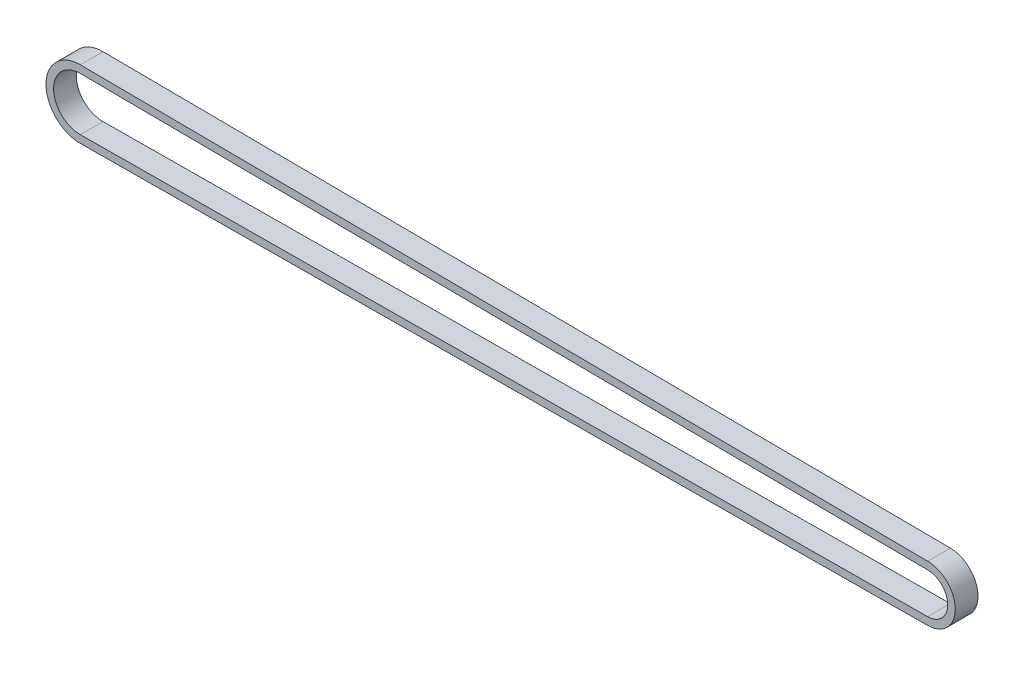
ISO-10303-21;
HEADER;
FILE_DESCRIPTION(('STEP AP214'),'2;1');
FILE_NAME('part.step','',(''),(''),'','','');
FILE_SCHEMA(('AUTOMOTIVE_DESIGN { 1 0 10303 214 1 1 1 1 }'));
ENDSEC;
DATA;
#1=APPLICATION_CONTEXT('core data for automotive mechanical design processes');
#2=APPLICATION_PROTOCOL_DEFINITION('international standard','automotive_design',2000,#1);
#3=PRODUCT_CONTEXT('',#1,'mechanical');
#4=PRODUCT('Part','Part','',(#3));
#5=PRODUCT_RELATED_PRODUCT_CATEGORY('part','',(#4));
#6=PRODUCT_DEFINITION_FORMATION('','',#4);
#7=PRODUCT_DEFINITION_CONTEXT('part definition',#1,'design');
#8=PRODUCT_DEFINITION('design','',#6,#7);
#9=PRODUCT_DEFINITION_SHAPE('','',#8);
#10=(LENGTH_UNIT() NAMED_UNIT(*) SI_UNIT(.MILLI.,.METRE.));
#11=(NAMED_UNIT(*) PLANE_ANGLE_UNIT() SI_UNIT($,.RADIAN.));
#12=(NAMED_UNIT(*) SI_UNIT($,.STERADIAN.) SOLID_ANGLE_UNIT());
#13=UNCERTAINTY_MEASURE_WITH_UNIT(LENGTH_MEASURE(1.E-05),#10,'distance_accuracy_value','');
#14=(GEOMETRIC_REPRESENTATION_CONTEXT(3) GLOBAL_UNCERTAINTY_ASSIGNED_CONTEXT((#13)) GLOBAL_UNIT_ASSIGNED_CONTEXT((#10,
#11,#12)) REPRESENTATION_CONTEXT('',''));
#15=CARTESIAN_POINT('',(0.,0.,0.));
#16=DIRECTION('',(0.,0.,1.));
#17=DIRECTION('',(1.,0.,0.));
#18=AXIS2_PLACEMENT_3D('',#15,#16,#17);
#19=CARTESIAN_POINT('',(112.823223304707,-5.48172618408671E-12,6.));
#20=DIRECTION('',(0.,0.,-1.));
#21=DIRECTION('',(-1.,0.,0.));
#22=AXIS2_PLACEMENT_3D('',#19,#20,#21);
#23=PLANE('',#22);
#24=CARTESIAN_POINT('',(112.823223304707,-5.48172618408671E-12,6.));
#25=DIRECTION('',(0.,0.,1.));
#26=DIRECTION('',(-1.,0.,0.));
#27=AXIS2_PLACEMENT_3D('',#24,#25,#26);
#28=CIRCLE('',#27,7.35355339059);
#29=CARTESIAN_POINT('',(112.877273452238,-7.35335474799701,6.));
#30=VERTEX_POINT('',#29);
#31=CARTESIAN_POINT('',(112.877273452239,7.35335474798604,6.));
#32=VERTEX_POINT('',#31);
#33=EDGE_CURVE('E159',#30,#32,#28,.T.);
#34=ORIENTED_EDGE('',*,*,#33,.T.);
#35=DIRECTION('',(-0.999972986855752,0.00735020807774755,0.));
#36=VECTOR('',#35,1.);
#37=CARTESIAN_POINT('',(-111.110624822597,8.99975688170177,6.));
#38=LINE('',#37,#36);
#39=CARTESIAN_POINT('',(-111.110624822597,8.99975688170177,6.));
#40=VERTEX_POINT('',#39);
#41=EDGE_CURVE('E163',#32,#40,#38,.T.);
#42=ORIENTED_EDGE('',*,*,#41,.T.);
#43=CARTESIAN_POINT('',(-111.176776695297,0.,6.));
#44=DIRECTION('',(0.,0.,1.));
#45=DIRECTION('',(-1.,0.,0.));
#46=AXIS2_PLACEMENT_3D('',#43,#44,#45);
#47=CIRCLE('',#46,9.);
#48=CARTESIAN_POINT('',(-111.110624822598,-8.99975688170177,6.));
#49=VERTEX_POINT('',#48);
#50=EDGE_CURVE('E167',#40,#49,#47,.T.);
#51=ORIENTED_EDGE('',*,*,#50,.T.);
#52=DIRECTION('',(0.999972986855752,0.0073502080776986,0.));
#53=VECTOR('',#52,1.);
#54=CARTESIAN_POINT('',(112.877273452238,-7.35335474799701,6.));
#55=LINE('',#54,#53);
#56=EDGE_CURVE('E170',#49,#30,#55,.T.);
#57=ORIENTED_EDGE('',*,*,#56,.T.);
#58=EDGE_LOOP('',(#34,#42,#51,#57));
#59=FACE_BOUND('',#58,.T.);
#60=CARTESIAN_POINT('',(112.823223304707,-5.48172618408671E-12,6.));
#61=DIRECTION('',(0.,0.,1.));
#62=DIRECTION('',(-1.,0.,0.));
#63=AXIS2_PLACEMENT_3D('',#60,#61,#62);
#64=CIRCLE('',#63,5.35355339059);
#65=CARTESIAN_POINT('',(112.862573036083,-5.3534087742855,6.));
#66=VERTEX_POINT('',#65);
#67=CARTESIAN_POINT('',(112.862573036083,5.35340877427454,6.));
#68=VERTEX_POINT('',#67);
#69=EDGE_CURVE('E111',#66,#68,#64,.T.);
#70=ORIENTED_EDGE('',*,*,#69,.F.);
#71=DIRECTION('',(0.999972986855752,0.0073502080776986,0.));
#72=VECTOR('',#71,1.);
#73=CARTESIAN_POINT('',(112.862573036083,-5.3534087742855,6.));
#74=LINE('',#73,#72);
#75=CARTESIAN_POINT('',(-111.125325238753,-6.99981090799027,6.));
#76=VERTEX_POINT('',#75);
#77=EDGE_CURVE('E137',#76,#66,#74,.T.);
#78=ORIENTED_EDGE('',*,*,#77,.F.);
#79=CARTESIAN_POINT('',(-111.176776695297,0.,6.));
#80=DIRECTION('',(0.,0.,1.));
#81=DIRECTION('',(-1.,0.,0.));
#82=AXIS2_PLACEMENT_3D('',#79,#80,#81);
#83=CIRCLE('',#82,7.);
#84=CARTESIAN_POINT('',(-111.125325238753,6.99981090799027,6.));
#85=VERTEX_POINT('',#84);
#86=EDGE_CURVE('E133',#85,#76,#83,.T.);
#87=ORIENTED_EDGE('',*,*,#86,.F.);
#88=DIRECTION('',(-0.999972986855752,0.00735020807774755,0.));
#89=VECTOR('',#88,1.);
#90=CARTESIAN_POINT('',(-111.125325238753,6.99981090799027,6.));
#91=LINE('',#90,#89);
#92=EDGE_CURVE('E120',#68,#85,#91,.T.);
#93=ORIENTED_EDGE('',*,*,#92,.F.);
#94=EDGE_LOOP('',(#70,#78,#87,#93));
#95=FACE_BOUND('',#94,.T.);
#96=ADVANCED_FACE('F45',(#59,#95),#23,.F.);
#97=CARTESIAN_POINT('',(112.823223304707,-5.48172618408671E-12,0.));
#98=DIRECTION('',(0.,0.,-1.));
#99=DIRECTION('',(-1.,0.,0.));
#100=AXIS2_PLACEMENT_3D('',#97,#98,#99);
#101=PLANE('',#100);
#102=CARTESIAN_POINT('',(112.823223304707,-5.48172618408671E-12,0.));
#103=DIRECTION('',(0.,0.,1.));
#104=DIRECTION('',(-1.,0.,0.));
#105=AXIS2_PLACEMENT_3D('',#102,#103,#104);
#106=CIRCLE('',#105,7.35355339059);
#107=CARTESIAN_POINT('',(112.877273452238,-7.35335474799701,0.));
#108=VERTEX_POINT('',#107);
#109=CARTESIAN_POINT('',(112.877273452239,7.35335474798604,0.));
#110=VERTEX_POINT('',#109);
#111=EDGE_CURVE('E129',#108,#110,#106,.T.);
#112=ORIENTED_EDGE('',*,*,#111,.F.);
#113=DIRECTION('',(0.999972986855752,0.0073502080776986,0.));
#114=VECTOR('',#113,1.);
#115=CARTESIAN_POINT('',(112.877273452238,-7.35335474799701,0.));
#116=LINE('',#115,#114);
#117=CARTESIAN_POINT('',(-111.110624822598,-8.99975688170177,0.));
#118=VERTEX_POINT('',#117);
#119=EDGE_CURVE('E164',#118,#108,#116,.T.);
#120=ORIENTED_EDGE('',*,*,#119,.F.);
#121=CARTESIAN_POINT('',(-111.176776695297,0.,0.));
#122=DIRECTION('',(0.,0.,1.));
#123=DIRECTION('',(-1.,0.,0.));
#124=AXIS2_PLACEMENT_3D('',#121,#122,#123);
#125=CIRCLE('',#124,9.);
#126=CARTESIAN_POINT('',(-111.110624822597,8.99975688170177,0.));
#127=VERTEX_POINT('',#126);
#128=EDGE_CURVE('E180',#127,#118,#125,.T.);
#129=ORIENTED_EDGE('',*,*,#128,.F.);
#130=DIRECTION('',(-0.999972986855752,0.00735020807774755,0.));
#131=VECTOR('',#130,1.);
#132=CARTESIAN_POINT('',(-111.110624822597,8.99975688170177,0.));
#133=LINE('',#132,#131);
#134=EDGE_CURVE('E177',#110,#127,#133,.T.);
#135=ORIENTED_EDGE('',*,*,#134,.F.);
#136=EDGE_LOOP('',(#112,#120,#129,#135));
#137=FACE_BOUND('',#136,.T.);
#138=DIRECTION('',(0.999972986855752,0.0073502080776986,0.));
#139=VECTOR('',#138,1.);
#140=CARTESIAN_POINT('',(112.862573036083,-5.3534087742855,0.));
#141=LINE('',#140,#139);
#142=CARTESIAN_POINT('',(-111.125325238753,-6.99981090799027,0.));
#143=VERTEX_POINT('',#142);
#144=CARTESIAN_POINT('',(112.862573036083,-5.3534087742855,0.));
#145=VERTEX_POINT('',#144);
#146=EDGE_CURVE('E121',#143,#145,#141,.T.);
#147=ORIENTED_EDGE('',*,*,#146,.T.);
#148=CARTESIAN_POINT('',(112.823223304707,-5.48172618408671E-12,0.));
#149=DIRECTION('',(0.,0.,1.));
#150=DIRECTION('',(-1.,0.,0.));
#151=AXIS2_PLACEMENT_3D('',#148,#149,#150);
#152=CIRCLE('',#151,5.35355339059);
#153=CARTESIAN_POINT('',(112.862573036083,5.35340877427454,0.));
#154=VERTEX_POINT('',#153);
#155=EDGE_CURVE('E69',#145,#154,#152,.T.);
#156=ORIENTED_EDGE('',*,*,#155,.T.);
#157=DIRECTION('',(-0.999972986855752,0.00735020807774755,0.));
#158=VECTOR('',#157,1.);
#159=CARTESIAN_POINT('',(-111.125325238753,6.99981090799027,0.));
#160=LINE('',#159,#158);
#161=CARTESIAN_POINT('',(-111.125325238753,6.99981090799027,0.));
#162=VERTEX_POINT('',#161);
#163=EDGE_CURVE('E127',#154,#162,#160,.T.);
#164=ORIENTED_EDGE('',*,*,#163,.T.);
#165=CARTESIAN_POINT('',(-111.176776695297,0.,0.));
#166=DIRECTION('',(0.,0.,1.));
#167=DIRECTION('',(-1.,0.,0.));
#168=AXIS2_PLACEMENT_3D('',#165,#166,#167);
#169=CIRCLE('',#168,7.);
#170=EDGE_CURVE('E146',#162,#143,#169,.T.);
#171=ORIENTED_EDGE('',*,*,#170,.T.);
#172=EDGE_LOOP('',(#147,#156,#164,#171));
#173=FACE_BOUND('',#172,.T.);
#174=ADVANCED_FACE('F203',(#137,#173),#101,.T.);
#175=CARTESIAN_POINT('',(112.823223304707,-5.48172618408671E-12,6.));
#176=DIRECTION('',(0.,0.,-1.));
#177=DIRECTION('',(-1.,0.,0.));
#178=AXIS2_PLACEMENT_3D('',#175,#176,#177);
#179=CYLINDRICAL_SURFACE('',#178,7.35355339059);
#180=ORIENTED_EDGE('',*,*,#111,.T.);
#181=DIRECTION('',(0.,0.,-1.));
#182=VECTOR('',#181,1.);
#183=CARTESIAN_POINT('',(112.877273452239,7.35335474798604,6.));
#184=LINE('',#183,#182);
#185=EDGE_CURVE('E11',#32,#110,#184,.T.);
#186=ORIENTED_EDGE('',*,*,#185,.F.);
#187=ORIENTED_EDGE('',*,*,#33,.F.);
#188=DIRECTION('',(0.,0.,-1.));
#189=VECTOR('',#188,1.);
#190=CARTESIAN_POINT('',(112.877273452238,-7.35335474799701,6.));
#191=LINE('',#190,#189);
#192=EDGE_CURVE('E173',#30,#108,#191,.T.);
#193=ORIENTED_EDGE('',*,*,#192,.T.);
#194=EDGE_LOOP('',(#180,#186,#187,#193));
#195=FACE_BOUND('',#194,.T.);
#196=ADVANCED_FACE('F47',(#195),#179,.T.);
#197=CARTESIAN_POINT('',(-111.110624822597,8.99975688170177,6.));
#198=DIRECTION('',(-0.00735020807774755,-0.999972986855752,0.));
#199=DIRECTION('',(0.999972986855752,-0.00735020807774755,0.));
#200=AXIS2_PLACEMENT_3D('',#197,#198,#199);
#201=PLANE('',#200);
#202=ORIENTED_EDGE('',*,*,#134,.T.);
#203=DIRECTION('',(0.,0.,-1.));
#204=VECTOR('',#203,1.);
#205=CARTESIAN_POINT('',(-111.110624822597,8.99975688170177,6.));
#206=LINE('',#205,#204);
#207=EDGE_CURVE('E54',#40,#127,#206,.T.);
#208=ORIENTED_EDGE('',*,*,#207,.F.);
#209=ORIENTED_EDGE('',*,*,#41,.F.);
#210=ORIENTED_EDGE('',*,*,#185,.T.);
#211=EDGE_LOOP('',(#202,#208,#209,#210));
#212=FACE_BOUND('',#211,.T.);
#213=ADVANCED_FACE('F213',(#212),#201,.F.);
#214=CARTESIAN_POINT('',(-111.176776695297,0.,6.));
#215=DIRECTION('',(0.,0.,-1.));
#216=DIRECTION('',(-1.,0.,0.));
#217=AXIS2_PLACEMENT_3D('',#214,#215,#216);
#218=CYLINDRICAL_SURFACE('',#217,9.);
#219=ORIENTED_EDGE('',*,*,#128,.T.);
#220=DIRECTION('',(0.,0.,-1.));
#221=VECTOR('',#220,1.);
#222=CARTESIAN_POINT('',(-111.110624822598,-8.99975688170177,6.));
#223=LINE('',#222,#221);
#224=EDGE_CURVE('E188',#49,#118,#223,.T.);
#225=ORIENTED_EDGE('',*,*,#224,.F.);
#226=ORIENTED_EDGE('',*,*,#50,.F.);
#227=ORIENTED_EDGE('',*,*,#207,.T.);
#228=EDGE_LOOP('',(#219,#225,#226,#227));
#229=FACE_BOUND('',#228,.T.);
#230=ADVANCED_FACE('F197',(#229),#218,.T.);
#231=CARTESIAN_POINT('',(112.877273452238,-7.35335474799701,6.));
#232=DIRECTION('',(-0.0073502080776986,0.999972986855752,0.));
#233=DIRECTION('',(-0.999972986855752,-0.0073502080776986,0.));
#234=AXIS2_PLACEMENT_3D('',#231,#232,#233);
#235=PLANE('',#234);
#236=ORIENTED_EDGE('',*,*,#119,.T.);
#237=ORIENTED_EDGE('',*,*,#192,.F.);
#238=ORIENTED_EDGE('',*,*,#56,.F.);
#239=ORIENTED_EDGE('',*,*,#224,.T.);
#240=EDGE_LOOP('',(#236,#237,#238,#239));
#241=FACE_BOUND('',#240,.T.);
#242=ADVANCED_FACE('F207',(#241),#235,.F.);
#243=CARTESIAN_POINT('',(112.823223304707,-5.48172618408671E-12,6.));
#244=DIRECTION('',(0.,0.,-1.));
#245=DIRECTION('',(-1.,0.,0.));
#246=AXIS2_PLACEMENT_3D('',#243,#244,#245);
#247=CYLINDRICAL_SURFACE('',#246,5.35355339059);
#248=ORIENTED_EDGE('',*,*,#155,.F.);
#249=DIRECTION('',(0.,0.,-1.));
#250=VECTOR('',#249,1.);
#251=CARTESIAN_POINT('',(112.862573036083,-5.3534087742855,6.));
#252=LINE('',#251,#250);
#253=EDGE_CURVE('E115',#66,#145,#252,.T.);
#254=ORIENTED_EDGE('',*,*,#253,.F.);
#255=ORIENTED_EDGE('',*,*,#69,.T.);
#256=DIRECTION('',(0.,0.,-1.));
#257=VECTOR('',#256,1.);
#258=CARTESIAN_POINT('',(112.862573036083,5.35340877427454,6.));
#259=LINE('',#258,#257);
#260=EDGE_CURVE('E114',#68,#154,#259,.T.);
#261=ORIENTED_EDGE('',*,*,#260,.T.);
#262=EDGE_LOOP('',(#248,#254,#255,#261));
#263=FACE_BOUND('',#262,.T.);
#264=ADVANCED_FACE('F113',(#263),#247,.F.);
#265=CARTESIAN_POINT('',(-111.125325238753,6.99981090799027,6.));
#266=DIRECTION('',(-0.00735020807774755,-0.999972986855752,0.));
#267=DIRECTION('',(0.999972986855752,-0.00735020807774755,0.));
#268=AXIS2_PLACEMENT_3D('',#265,#266,#267);
#269=PLANE('',#268);
#270=ORIENTED_EDGE('',*,*,#163,.F.);
#271=ORIENTED_EDGE('',*,*,#260,.F.);
#272=ORIENTED_EDGE('',*,*,#92,.T.);
#273=DIRECTION('',(0.,0.,-1.));
#274=VECTOR('',#273,1.);
#275=CARTESIAN_POINT('',(-111.125325238753,6.99981090799027,6.));
#276=LINE('',#275,#274);
#277=EDGE_CURVE('E130',#85,#162,#276,.T.);
#278=ORIENTED_EDGE('',*,*,#277,.T.);
#279=EDGE_LOOP('',(#270,#271,#272,#278));
#280=FACE_BOUND('',#279,.T.);
#281=ADVANCED_FACE('F124',(#280),#269,.T.);
#282=CARTESIAN_POINT('',(-111.176776695297,0.,6.));
#283=DIRECTION('',(0.,0.,-1.));
#284=DIRECTION('',(-1.,0.,0.));
#285=AXIS2_PLACEMENT_3D('',#282,#283,#284);
#286=CYLINDRICAL_SURFACE('',#285,7.);
#287=ORIENTED_EDGE('',*,*,#170,.F.);
#288=ORIENTED_EDGE('',*,*,#277,.F.);
#289=ORIENTED_EDGE('',*,*,#86,.T.);
#290=DIRECTION('',(0.,0.,-1.));
#291=VECTOR('',#290,1.);
#292=CARTESIAN_POINT('',(-111.125325238753,-6.99981090799027,6.));
#293=LINE('',#292,#291);
#294=EDGE_CURVE('E61',#76,#143,#293,.T.);
#295=ORIENTED_EDGE('',*,*,#294,.T.);
#296=EDGE_LOOP('',(#287,#288,#289,#295));
#297=FACE_BOUND('',#296,.T.);
#298=ADVANCED_FACE('F236',(#297),#286,.F.);
#299=CARTESIAN_POINT('',(112.862573036083,-5.3534087742855,6.));
#300=DIRECTION('',(-0.0073502080776986,0.999972986855752,0.));
#301=DIRECTION('',(-0.999972986855752,-0.0073502080776986,0.));
#302=AXIS2_PLACEMENT_3D('',#299,#300,#301);
#303=PLANE('',#302);
#304=ORIENTED_EDGE('',*,*,#146,.F.);
#305=ORIENTED_EDGE('',*,*,#294,.F.);
#306=ORIENTED_EDGE('',*,*,#77,.T.);
#307=ORIENTED_EDGE('',*,*,#253,.T.);
#308=EDGE_LOOP('',(#304,#305,#306,#307));
#309=FACE_BOUND('',#308,.T.);
#310=ADVANCED_FACE('F240',(#309),#303,.T.);
#311=CLOSED_SHELL('',(#96,#174,#196,#213,#230,#242,#264,#281,#298,#310));
#312=MANIFOLD_SOLID_BREP('B2',#311);
#313=ADVANCED_BREP_SHAPE_REPRESENTATION('',(#18,#312),#14);
#314=SHAPE_DEFINITION_REPRESENTATION(#9,#313);
ENDSEC;
END-ISO-10303-21;
